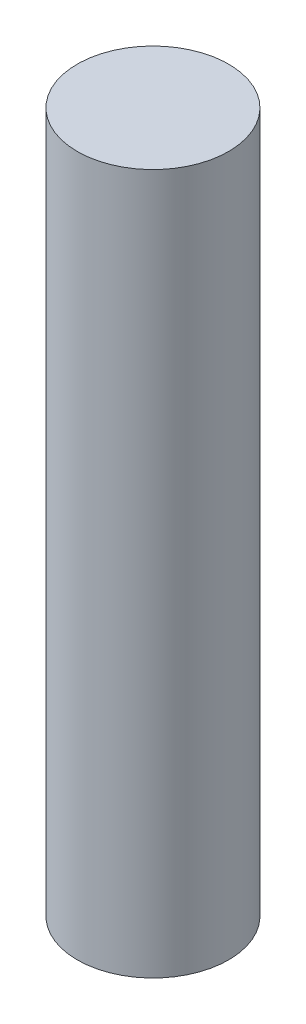
ISO-10303-21;
HEADER;
FILE_DESCRIPTION(('STEP AP214'),'2;1');
FILE_NAME('part.step','',(''),(''),'','','');
FILE_SCHEMA(('AUTOMOTIVE_DESIGN { 1 0 10303 214 1 1 1 1 }'));
ENDSEC;
DATA;
#1=APPLICATION_CONTEXT('core data for automotive mechanical design processes');
#2=APPLICATION_PROTOCOL_DEFINITION('international standard','automotive_design',2000,#1);
#3=PRODUCT_CONTEXT('',#1,'mechanical');
#4=PRODUCT('Part','Part','',(#3));
#5=PRODUCT_RELATED_PRODUCT_CATEGORY('part','',(#4));
#6=PRODUCT_DEFINITION_FORMATION('','',#4);
#7=PRODUCT_DEFINITION_CONTEXT('part definition',#1,'design');
#8=PRODUCT_DEFINITION('design','',#6,#7);
#9=PRODUCT_DEFINITION_SHAPE('','',#8);
#10=(LENGTH_UNIT() NAMED_UNIT(*) SI_UNIT(.MILLI.,.METRE.));
#11=(NAMED_UNIT(*) PLANE_ANGLE_UNIT() SI_UNIT($,.RADIAN.));
#12=(NAMED_UNIT(*) SI_UNIT($,.STERADIAN.) SOLID_ANGLE_UNIT());
#13=UNCERTAINTY_MEASURE_WITH_UNIT(LENGTH_MEASURE(1.E-05),#10,'distance_accuracy_value','');
#14=(GEOMETRIC_REPRESENTATION_CONTEXT(3) GLOBAL_UNCERTAINTY_ASSIGNED_CONTEXT((#13)) GLOBAL_UNIT_ASSIGNED_CONTEXT((#10,
#11,#12)) REPRESENTATION_CONTEXT('',''));
#15=CARTESIAN_POINT('',(0.,0.,0.));
#16=DIRECTION('',(0.,0.,1.));
#17=DIRECTION('',(1.,0.,0.));
#18=AXIS2_PLACEMENT_3D('',#15,#16,#17);
#19=CARTESIAN_POINT('',(0.,3.7,0.));
#20=DIRECTION('',(0.,-1.,0.));
#21=DIRECTION('',(0.,0.,-1.));
#22=AXIS2_PLACEMENT_3D('',#19,#20,#21);
#23=CYLINDRICAL_SURFACE('',#22,0.4);
#24=CARTESIAN_POINT('',(0.,3.7,0.));
#25=DIRECTION('',(0.,1.,0.));
#26=DIRECTION('',(0.,0.,1.));
#27=AXIS2_PLACEMENT_3D('',#24,#25,#26);
#28=CIRCLE('',#27,0.4);
#29=CARTESIAN_POINT('',(0.,3.7,0.4));
#30=VERTEX_POINT('',#29);
#31=EDGE_CURVE('E10',#30,#30,#28,.T.);
#32=ORIENTED_EDGE('',*,*,#31,.F.);
#33=EDGE_LOOP('',(#32));
#34=FACE_BOUND('',#33,.T.);
#35=CARTESIAN_POINT('',(0.,0.,0.));
#36=DIRECTION('',(0.,1.,0.));
#37=DIRECTION('',(0.,0.,1.));
#38=AXIS2_PLACEMENT_3D('',#35,#36,#37);
#39=CIRCLE('',#38,0.4);
#40=CARTESIAN_POINT('',(0.,0.,0.4));
#41=VERTEX_POINT('',#40);
#42=EDGE_CURVE('E33',#41,#41,#39,.T.);
#43=ORIENTED_EDGE('',*,*,#42,.T.);
#44=EDGE_LOOP('',(#43));
#45=FACE_BOUND('',#44,.T.);
#46=ADVANCED_FACE('F30',(#34,#45),#23,.T.);
#47=CARTESIAN_POINT('',(0.,3.7,0.));
#48=DIRECTION('',(0.,1.,0.));
#49=DIRECTION('',(0.,0.,1.));
#50=AXIS2_PLACEMENT_3D('',#47,#48,#49);
#51=PLANE('',#50);
#52=ORIENTED_EDGE('',*,*,#31,.T.);
#53=EDGE_LOOP('',(#52));
#54=FACE_BOUND('',#53,.T.);
#55=ADVANCED_FACE('F45',(#54),#51,.T.);
#56=CARTESIAN_POINT('',(0.,0.,0.));
#57=DIRECTION('',(0.,1.,0.));
#58=DIRECTION('',(0.,0.,1.));
#59=AXIS2_PLACEMENT_3D('',#56,#57,#58);
#60=PLANE('',#59);
#61=ORIENTED_EDGE('',*,*,#42,.F.);
#62=EDGE_LOOP('',(#61));
#63=FACE_BOUND('',#62,.T.);
#64=ADVANCED_FACE('F43',(#63),#60,.F.);
#65=CLOSED_SHELL('',(#46,#55,#64));
#66=MANIFOLD_SOLID_BREP('B2',#65);
#67=ADVANCED_BREP_SHAPE_REPRESENTATION('',(#18,#66),#14);
#68=SHAPE_DEFINITION_REPRESENTATION(#9,#67);
ENDSEC;
END-ISO-10303-21;
